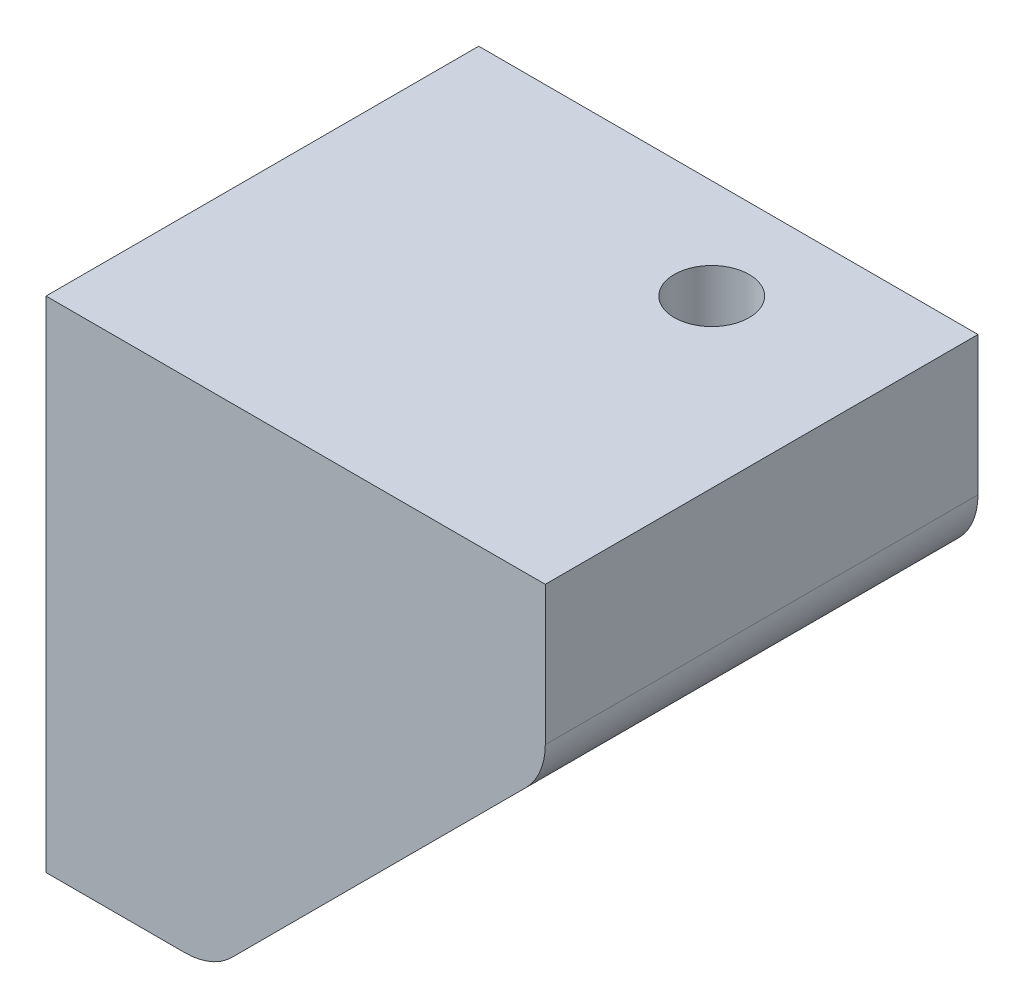
ISO-10303-21;
HEADER;
FILE_DESCRIPTION(('STEP AP214'),'2;1');
FILE_NAME('part.step','',(''),(''),'','','');
FILE_SCHEMA(('AUTOMOTIVE_DESIGN { 1 0 10303 214 1 1 1 1 }'));
ENDSEC;
DATA;
#1=APPLICATION_CONTEXT('core data for automotive mechanical design processes');
#2=APPLICATION_PROTOCOL_DEFINITION('international standard','automotive_design',2000,#1);
#3=PRODUCT_CONTEXT('',#1,'mechanical');
#4=PRODUCT('Part','Part','',(#3));
#5=PRODUCT_RELATED_PRODUCT_CATEGORY('part','',(#4));
#6=PRODUCT_DEFINITION_FORMATION('','',#4);
#7=PRODUCT_DEFINITION_CONTEXT('part definition',#1,'design');
#8=PRODUCT_DEFINITION('design','',#6,#7);
#9=PRODUCT_DEFINITION_SHAPE('','',#8);
#10=(LENGTH_UNIT() NAMED_UNIT(*) SI_UNIT(.MILLI.,.METRE.));
#11=(NAMED_UNIT(*) PLANE_ANGLE_UNIT() SI_UNIT($,.RADIAN.));
#12=(NAMED_UNIT(*) SI_UNIT($,.STERADIAN.) SOLID_ANGLE_UNIT());
#13=UNCERTAINTY_MEASURE_WITH_UNIT(LENGTH_MEASURE(1.E-05),#10,'distance_accuracy_value','');
#14=(GEOMETRIC_REPRESENTATION_CONTEXT(3) GLOBAL_UNCERTAINTY_ASSIGNED_CONTEXT((#13)) GLOBAL_UNIT_ASSIGNED_CONTEXT((#10,
#11,#12)) REPRESENTATION_CONTEXT('',''));
#15=CARTESIAN_POINT('',(0.,0.,0.));
#16=DIRECTION('',(0.,0.,1.));
#17=DIRECTION('',(1.,0.,0.));
#18=AXIS2_PLACEMENT_3D('',#15,#16,#17);
#19=CARTESIAN_POINT('',(0.,30.0000000000001,26.));
#20=DIRECTION('',(1.,0.,0.));
#21=DIRECTION('',(0.,1.,0.));
#22=AXIS2_PLACEMENT_3D('',#19,#20,#21);
#23=PLANE('',#22);
#24=CARTESIAN_POINT('',(0.,10.,18.));
#25=DIRECTION('',(-1.,0.,0.));
#26=DIRECTION('',(0.,-1.,0.));
#27=AXIS2_PLACEMENT_3D('',#24,#25,#26);
#28=CIRCLE('',#27,2.5);
#29=CARTESIAN_POINT('',(0.,7.50000000000004,18.));
#30=VERTEX_POINT('',#29);
#31=EDGE_CURVE('E146',#30,#30,#28,.T.);
#32=ORIENTED_EDGE('',*,*,#31,.F.);
#33=EDGE_LOOP('',(#32));
#34=FACE_BOUND('',#33,.T.);
#35=DIRECTION('',(0.,-1.,0.));
#36=VECTOR('',#35,1.);
#37=CARTESIAN_POINT('',(0.,30.0000000000001,0.));
#38=LINE('',#37,#36);
#39=CARTESIAN_POINT('',(0.,30.0000000000001,0.));
#40=VERTEX_POINT('',#39);
#41=CARTESIAN_POINT('',(0.,0.,0.));
#42=VERTEX_POINT('',#41);
#43=EDGE_CURVE('E127',#40,#42,#38,.T.);
#44=ORIENTED_EDGE('',*,*,#43,.T.);
#45=DIRECTION('',(0.,0.,-1.));
#46=VECTOR('',#45,1.);
#47=CARTESIAN_POINT('',(0.,0.,26.));
#48=LINE('',#47,#46);
#49=CARTESIAN_POINT('',(0.,0.,26.));
#50=VERTEX_POINT('',#49);
#51=EDGE_CURVE('E109',#50,#42,#48,.T.);
#52=ORIENTED_EDGE('',*,*,#51,.F.);
#53=DIRECTION('',(0.,-1.,0.));
#54=VECTOR('',#53,1.);
#55=CARTESIAN_POINT('',(0.,30.0000000000001,26.));
#56=LINE('',#55,#54);
#57=CARTESIAN_POINT('',(0.,30.0000000000001,26.));
#58=VERTEX_POINT('',#57);
#59=EDGE_CURVE('E114',#58,#50,#56,.T.);
#60=ORIENTED_EDGE('',*,*,#59,.F.);
#61=DIRECTION('',(0.,0.,-1.));
#62=VECTOR('',#61,1.);
#63=CARTESIAN_POINT('',(0.,30.0000000000001,26.));
#64=LINE('',#63,#62);
#65=EDGE_CURVE('E138',#58,#40,#64,.T.);
#66=ORIENTED_EDGE('',*,*,#65,.T.);
#67=EDGE_LOOP('',(#44,#52,#60,#66));
#68=FACE_BOUND('',#67,.T.);
#69=ADVANCED_FACE('F45',(#34,#68),#23,.F.);
#70=CARTESIAN_POINT('',(0.,0.,26.));
#71=DIRECTION('',(0.,1.,0.));
#72=DIRECTION('',(0.,0.,1.));
#73=AXIS2_PLACEMENT_3D('',#70,#71,#72);
#74=PLANE('',#73);
#75=DIRECTION('',(1.,0.,0.));
#76=VECTOR('',#75,1.);
#77=CARTESIAN_POINT('',(0.,0.,0.));
#78=LINE('',#77,#76);
#79=CARTESIAN_POINT('',(8.34314575050761,0.,0.));
#80=VERTEX_POINT('',#79);
#81=EDGE_CURVE('E190',#42,#80,#78,.T.);
#82=ORIENTED_EDGE('',*,*,#81,.T.);
#83=DIRECTION('',(0.,0.,-1.));
#84=VECTOR('',#83,1.);
#85=CARTESIAN_POINT('',(8.34314575050762,0.,26.));
#86=LINE('',#85,#84);
#87=CARTESIAN_POINT('',(8.34314575050761,0.,26.));
#88=VERTEX_POINT('',#87);
#89=EDGE_CURVE('E69',#80,#88,#86,.F.);
#90=ORIENTED_EDGE('',*,*,#89,.T.);
#91=DIRECTION('',(1.,0.,0.));
#92=VECTOR('',#91,1.);
#93=CARTESIAN_POINT('',(0.,0.,26.));
#94=LINE('',#93,#92);
#95=EDGE_CURVE('E105',#50,#88,#94,.T.);
#96=ORIENTED_EDGE('',*,*,#95,.F.);
#97=ORIENTED_EDGE('',*,*,#51,.T.);
#98=EDGE_LOOP('',(#82,#90,#96,#97));
#99=FACE_BOUND('',#98,.T.);
#100=ADVANCED_FACE('F107',(#99),#74,.F.);
#101=CARTESIAN_POINT('',(10.,0.,26.));
#102=DIRECTION('',(-0.707106781186549,0.707106781186546,0.));
#103=DIRECTION('',(-0.707106781186546,-0.707106781186549,0.));
#104=AXIS2_PLACEMENT_3D('',#101,#102,#103);
#105=PLANE('',#104);
#106=CARTESIAN_POINT('',(20.,10.,6.));
#107=DIRECTION('',(-0.707106781186549,0.707106781186546,0.));
#108=DIRECTION('',(0.707106781186546,0.707106781186549,0.));
#109=AXIS2_PLACEMENT_3D('',#106,#107,#108);
#110=ELLIPSE('',#109,5.65685424949239,4.);
#111=CARTESIAN_POINT('',(24.,14.0000000000001,6.));
#112=VERTEX_POINT('',#111);
#113=EDGE_CURVE('E147',#112,#112,#110,.T.);
#114=ORIENTED_EDGE('',*,*,#113,.T.);
#115=EDGE_LOOP('',(#114));
#116=FACE_BOUND('',#115,.T.);
#117=CARTESIAN_POINT('',(20.,10.,18.));
#118=DIRECTION('',(-0.707106781186549,0.707106781186546,0.));
#119=DIRECTION('',(-0.707106781186546,-0.707106781186549,0.));
#120=AXIS2_PLACEMENT_3D('',#117,#118,#119);
#121=ELLIPSE('',#120,7.07106781186546,5.);
#122=CARTESIAN_POINT('',(15.,5.00000000000004,18.));
#123=VERTEX_POINT('',#122);
#124=EDGE_CURVE('E142',#123,#123,#121,.T.);
#125=ORIENTED_EDGE('',*,*,#124,.T.);
#126=EDGE_LOOP('',(#125));
#127=FACE_BOUND('',#126,.T.);
#128=DIRECTION('',(0.707106781186546,0.707106781186549,0.));
#129=VECTOR('',#128,1.);
#130=CARTESIAN_POINT('',(10.,0.,26.));
#131=LINE('',#130,#129);
#132=CARTESIAN_POINT('',(11.1715728752538,1.17157287525382,26.));
#133=VERTEX_POINT('',#132);
#134=CARTESIAN_POINT('',(28.8284271247462,18.8284271247463,26.));
#135=VERTEX_POINT('',#134);
#136=EDGE_CURVE('E113',#133,#135,#131,.T.);
#137=ORIENTED_EDGE('',*,*,#136,.F.);
#138=DIRECTION('',(0.,0.,-1.));
#139=VECTOR('',#138,1.);
#140=CARTESIAN_POINT('',(11.1715728752538,1.17157287525382,26.));
#141=LINE('',#140,#139);
#142=CARTESIAN_POINT('',(11.1715728752538,1.17157287525382,0.));
#143=VERTEX_POINT('',#142);
#144=EDGE_CURVE('E162',#133,#143,#141,.T.);
#145=ORIENTED_EDGE('',*,*,#144,.T.);
#146=DIRECTION('',(0.707106781186546,0.707106781186549,0.));
#147=VECTOR('',#146,1.);
#148=CARTESIAN_POINT('',(10.,0.,0.));
#149=LINE('',#148,#147);
#150=CARTESIAN_POINT('',(28.8284271247462,18.8284271247463,0.));
#151=VERTEX_POINT('',#150);
#152=EDGE_CURVE('E191',#143,#151,#149,.T.);
#153=ORIENTED_EDGE('',*,*,#152,.T.);
#154=DIRECTION('',(0.,0.,-1.));
#155=VECTOR('',#154,1.);
#156=CARTESIAN_POINT('',(28.8284271247462,18.8284271247463,26.));
#157=LINE('',#156,#155);
#158=EDGE_CURVE('E159',#151,#135,#157,.F.);
#159=ORIENTED_EDGE('',*,*,#158,.T.);
#160=EDGE_LOOP('',(#137,#145,#153,#159));
#161=FACE_BOUND('',#160,.T.);
#162=ADVANCED_FACE('F180',(#116,#127,#161),#105,.F.);
#163=CARTESIAN_POINT('',(30.,20.0000000000001,26.));
#164=DIRECTION('',(-1.,0.,0.));
#165=DIRECTION('',(0.,0.,1.));
#166=AXIS2_PLACEMENT_3D('',#163,#164,#165);
#167=PLANE('',#166);
#168=DIRECTION('',(0.,1.,0.));
#169=VECTOR('',#168,1.);
#170=CARTESIAN_POINT('',(30.,20.0000000000001,26.));
#171=LINE('',#170,#169);
#172=CARTESIAN_POINT('',(30.,21.6568542494925,26.));
#173=VERTEX_POINT('',#172);
#174=CARTESIAN_POINT('',(30.,30.0000000000001,26.));
#175=VERTEX_POINT('',#174);
#176=EDGE_CURVE('E185',#173,#175,#171,.T.);
#177=ORIENTED_EDGE('',*,*,#176,.F.);
#178=DIRECTION('',(0.,0.,-1.));
#179=VECTOR('',#178,1.);
#180=CARTESIAN_POINT('',(30.,21.6568542494925,26.));
#181=LINE('',#180,#179);
#182=CARTESIAN_POINT('',(30.,21.6568542494925,0.));
#183=VERTEX_POINT('',#182);
#184=EDGE_CURVE('E11',#173,#183,#181,.T.);
#185=ORIENTED_EDGE('',*,*,#184,.T.);
#186=DIRECTION('',(0.,1.,0.));
#187=VECTOR('',#186,1.);
#188=CARTESIAN_POINT('',(30.,20.0000000000001,0.));
#189=LINE('',#188,#187);
#190=CARTESIAN_POINT('',(30.,30.0000000000001,0.));
#191=VERTEX_POINT('',#190);
#192=EDGE_CURVE('E196',#183,#191,#189,.T.);
#193=ORIENTED_EDGE('',*,*,#192,.T.);
#194=DIRECTION('',(0.,0.,-1.));
#195=VECTOR('',#194,1.);
#196=CARTESIAN_POINT('',(30.,30.0000000000001,26.));
#197=LINE('',#196,#195);
#198=EDGE_CURVE('E130',#175,#191,#197,.T.);
#199=ORIENTED_EDGE('',*,*,#198,.F.);
#200=EDGE_LOOP('',(#177,#185,#193,#199));
#201=FACE_BOUND('',#200,.T.);
#202=ADVANCED_FACE('F240',(#201),#167,.F.);
#203=CARTESIAN_POINT('',(30.,30.0000000000001,26.));
#204=DIRECTION('',(0.,-1.,0.));
#205=DIRECTION('',(1.,0.,0.));
#206=AXIS2_PLACEMENT_3D('',#203,#204,#205);
#207=PLANE('',#206);
#208=CARTESIAN_POINT('',(20.,30.0000000000001,6.));
#209=DIRECTION('',(0.,1.,0.));
#210=DIRECTION('',(-1.,0.,0.));
#211=AXIS2_PLACEMENT_3D('',#208,#209,#210);
#212=CIRCLE('',#211,2.25);
#213=CARTESIAN_POINT('',(17.75,30.0000000000001,6.));
#214=VERTEX_POINT('',#213);
#215=EDGE_CURVE('E198',#214,#214,#212,.T.);
#216=ORIENTED_EDGE('',*,*,#215,.F.);
#217=EDGE_LOOP('',(#216));
#218=FACE_BOUND('',#217,.T.);
#219=DIRECTION('',(-1.,0.,0.));
#220=VECTOR('',#219,1.);
#221=CARTESIAN_POINT('',(30.,30.0000000000001,0.));
#222=LINE('',#221,#220);
#223=EDGE_CURVE('E124',#191,#40,#222,.T.);
#224=ORIENTED_EDGE('',*,*,#223,.T.);
#225=ORIENTED_EDGE('',*,*,#65,.F.);
#226=DIRECTION('',(-1.,0.,0.));
#227=VECTOR('',#226,1.);
#228=CARTESIAN_POINT('',(30.,30.0000000000001,26.));
#229=LINE('',#228,#227);
#230=EDGE_CURVE('E119',#175,#58,#229,.T.);
#231=ORIENTED_EDGE('',*,*,#230,.F.);
#232=ORIENTED_EDGE('',*,*,#198,.T.);
#233=EDGE_LOOP('',(#224,#225,#231,#232));
#234=FACE_BOUND('',#233,.T.);
#235=ADVANCED_FACE('F237',(#218,#234),#207,.F.);
#236=CARTESIAN_POINT('',(0.,0.,26.));
#237=DIRECTION('',(0.,0.,1.));
#238=DIRECTION('',(1.,0.,0.));
#239=AXIS2_PLACEMENT_3D('',#236,#237,#238);
#240=PLANE('',#239);
#241=ORIENTED_EDGE('',*,*,#95,.T.);
#242=CARTESIAN_POINT('',(8.34314575050762,4.,26.));
#243=DIRECTION('',(0.,0.,1.));
#244=DIRECTION('',(1.,0.,0.));
#245=AXIS2_PLACEMENT_3D('',#242,#243,#244);
#246=CIRCLE('',#245,4.);
#247=EDGE_CURVE('E54',#88,#133,#246,.T.);
#248=ORIENTED_EDGE('',*,*,#247,.T.);
#249=ORIENTED_EDGE('',*,*,#136,.T.);
#250=CARTESIAN_POINT('',(26.,21.6568542494925,26.));
#251=DIRECTION('',(0.,0.,1.));
#252=DIRECTION('',(1.,0.,0.));
#253=AXIS2_PLACEMENT_3D('',#250,#251,#252);
#254=CIRCLE('',#253,4.);
#255=EDGE_CURVE('E61',#135,#173,#254,.T.);
#256=ORIENTED_EDGE('',*,*,#255,.T.);
#257=ORIENTED_EDGE('',*,*,#176,.T.);
#258=ORIENTED_EDGE('',*,*,#230,.T.);
#259=ORIENTED_EDGE('',*,*,#59,.T.);
#260=EDGE_LOOP('',(#241,#248,#249,#256,#257,#258,#259));
#261=FACE_BOUND('',#260,.T.);
#262=ADVANCED_FACE('F117',(#261),#240,.T.);
#263=CARTESIAN_POINT('',(0.,0.,0.));
#264=DIRECTION('',(0.,0.,1.));
#265=DIRECTION('',(1.,0.,0.));
#266=AXIS2_PLACEMENT_3D('',#263,#264,#265);
#267=PLANE('',#266);
#268=ORIENTED_EDGE('',*,*,#152,.F.);
#269=CARTESIAN_POINT('',(8.34314575050762,4.,0.));
#270=DIRECTION('',(0.,0.,1.));
#271=DIRECTION('',(1.,0.,0.));
#272=AXIS2_PLACEMENT_3D('',#269,#270,#271);
#273=CIRCLE('',#272,4.);
#274=EDGE_CURVE('E169',#143,#80,#273,.F.);
#275=ORIENTED_EDGE('',*,*,#274,.T.);
#276=ORIENTED_EDGE('',*,*,#81,.F.);
#277=ORIENTED_EDGE('',*,*,#43,.F.);
#278=ORIENTED_EDGE('',*,*,#223,.F.);
#279=ORIENTED_EDGE('',*,*,#192,.F.);
#280=CARTESIAN_POINT('',(26.,21.6568542494925,0.));
#281=DIRECTION('',(0.,0.,1.));
#282=DIRECTION('',(1.,0.,0.));
#283=AXIS2_PLACEMENT_3D('',#280,#281,#282);
#284=CIRCLE('',#283,4.);
#285=EDGE_CURVE('E166',#183,#151,#284,.F.);
#286=ORIENTED_EDGE('',*,*,#285,.T.);
#287=EDGE_LOOP('',(#268,#275,#276,#277,#278,#279,#286));
#288=FACE_BOUND('',#287,.T.);
#289=ADVANCED_FACE('F189',(#288),#267,.F.);
#290=CARTESIAN_POINT('',(20.,0.,6.));
#291=DIRECTION('',(0.,1.,0.));
#292=DIRECTION('',(-1.,0.,0.));
#293=AXIS2_PLACEMENT_3D('',#290,#291,#292);
#294=CYLINDRICAL_SURFACE('',#293,2.25);
#295=CARTESIAN_POINT('',(20.,20.0000000000001,6.));
#296=DIRECTION('',(0.,1.,0.));
#297=DIRECTION('',(-1.,0.,0.));
#298=AXIS2_PLACEMENT_3D('',#295,#296,#297);
#299=CIRCLE('',#298,2.25);
#300=CARTESIAN_POINT('',(17.75,20.0000000000001,6.));
#301=VERTEX_POINT('',#300);
#302=EDGE_CURVE('E148',#301,#301,#299,.F.);
#303=CARTESIAN_POINT('',(17.75,20.0000000000001,6.));
#304=CARTESIAN_POINT('',(17.75,20.1041666666667,6.));
#305=CARTESIAN_POINT('',(17.75,20.2083333333334,6.));
#306=CARTESIAN_POINT('',(17.75,20.4166666666667,6.));
#307=CARTESIAN_POINT('',(17.75,20.5208333333334,6.));
#308=CARTESIAN_POINT('',(17.75,20.7291666666667,6.));
#309=CARTESIAN_POINT('',(17.75,20.8333333333334,6.));
#310=CARTESIAN_POINT('',(17.75,21.0416666666667,6.));
#311=CARTESIAN_POINT('',(17.75,21.1458333333334,6.));
#312=CARTESIAN_POINT('',(17.75,21.3541666666667,6.));
#313=CARTESIAN_POINT('',(17.75,21.4583333333334,6.));
#314=CARTESIAN_POINT('',(17.75,21.6666666666667,6.));
#315=CARTESIAN_POINT('',(17.75,21.7708333333334,6.));
#316=CARTESIAN_POINT('',(17.75,21.9791666666667,6.));
#317=CARTESIAN_POINT('',(17.75,22.0833333333334,6.));
#318=CARTESIAN_POINT('',(17.75,22.2916666666667,6.));
#319=CARTESIAN_POINT('',(17.75,22.3958333333334,6.));
#320=CARTESIAN_POINT('',(17.75,22.6041666666667,6.));
#321=CARTESIAN_POINT('',(17.75,22.7083333333334,6.));
#322=CARTESIAN_POINT('',(17.75,22.9166666666667,6.));
#323=CARTESIAN_POINT('',(17.75,23.0208333333334,6.));
#324=CARTESIAN_POINT('',(17.75,23.2291666666667,6.));
#325=CARTESIAN_POINT('',(17.75,23.3333333333334,6.));
#326=CARTESIAN_POINT('',(17.75,23.5416666666667,6.));
#327=CARTESIAN_POINT('',(17.75,23.6458333333334,6.));
#328=CARTESIAN_POINT('',(17.75,23.8541666666667,6.));
#329=CARTESIAN_POINT('',(17.75,23.9583333333334,6.));
#330=CARTESIAN_POINT('',(17.75,24.1666666666667,6.));
#331=CARTESIAN_POINT('',(17.75,24.2708333333334,6.));
#332=CARTESIAN_POINT('',(17.75,24.4791666666667,6.));
#333=CARTESIAN_POINT('',(17.75,24.5833333333334,6.));
#334=CARTESIAN_POINT('',(17.75,24.7916666666667,6.));
#335=CARTESIAN_POINT('',(17.75,24.8958333333334,6.));
#336=CARTESIAN_POINT('',(17.75,25.1041666666667,6.));
#337=CARTESIAN_POINT('',(17.75,25.2083333333334,6.));
#338=CARTESIAN_POINT('',(17.75,25.4166666666667,6.));
#339=CARTESIAN_POINT('',(17.75,25.5208333333334,6.));
#340=CARTESIAN_POINT('',(17.75,25.7291666666667,6.));
#341=CARTESIAN_POINT('',(17.75,25.8333333333334,6.));
#342=CARTESIAN_POINT('',(17.75,26.0416666666667,6.));
#343=CARTESIAN_POINT('',(17.75,26.1458333333334,6.));
#344=CARTESIAN_POINT('',(17.75,26.3541666666667,6.));
#345=CARTESIAN_POINT('',(17.75,26.4583333333334,6.));
#346=CARTESIAN_POINT('',(17.75,26.6666666666667,6.));
#347=CARTESIAN_POINT('',(17.75,26.7708333333334,6.));
#348=CARTESIAN_POINT('',(17.75,26.9791666666667,6.));
#349=CARTESIAN_POINT('',(17.75,27.0833333333334,6.));
#350=CARTESIAN_POINT('',(17.75,27.2916666666667,6.));
#351=CARTESIAN_POINT('',(17.75,27.3958333333334,6.));
#352=CARTESIAN_POINT('',(17.75,27.6041666666667,6.));
#353=CARTESIAN_POINT('',(17.75,27.7083333333334,6.));
#354=CARTESIAN_POINT('',(17.75,27.9166666666667,6.));
#355=CARTESIAN_POINT('',(17.75,28.0208333333334,6.));
#356=CARTESIAN_POINT('',(17.75,28.2291666666667,6.));
#357=CARTESIAN_POINT('',(17.75,28.3333333333334,6.));
#358=CARTESIAN_POINT('',(17.75,28.5416666666667,6.));
#359=CARTESIAN_POINT('',(17.75,28.6458333333334,6.));
#360=CARTESIAN_POINT('',(17.75,28.8541666666667,6.));
#361=CARTESIAN_POINT('',(17.75,28.9583333333334,6.));
#362=CARTESIAN_POINT('',(17.75,29.1666666666667,6.));
#363=CARTESIAN_POINT('',(17.75,29.2708333333334,6.));
#364=CARTESIAN_POINT('',(17.75,29.4791666666667,6.));
#365=CARTESIAN_POINT('',(17.75,29.5833333333334,6.));
#366=CARTESIAN_POINT('',(17.75,29.7916666666667,6.));
#367=CARTESIAN_POINT('',(17.75,29.8958333333334,6.));
#368=CARTESIAN_POINT('',(17.75,30.0000000000001,6.));
#369=B_SPLINE_CURVE_WITH_KNOTS('',3,(#303,#304,#305,#306,#307,#308,#309,#310,#311,#312,#313,
#314,#315,#316,#317,#318,#319,#320,#321,#322,#323,#324,#325,#326,#327,#328,#329,#330,#331,#332,
#333,#334,#335,#336,#337,#338,#339,#340,#341,#342,#343,#344,#345,#346,#347,#348,#349,#350,#351,
#352,#353,#354,#355,#356,#357,#358,#359,#360,#361,#362,#363,#364,#365,#366,#367,#368),
.UNSPECIFIED.,.F.,.F.,(4,2,2,2,2,2,2,2,2,2,2,2,2,2,2,2,2,2,2,2,2,2,2,2,2,2,2,2,2,2,2,2,4),(0.,
0.3125,0.625000000000001,0.937500000000001,1.25,1.5625,1.875,2.1875,2.5,2.8125,3.125,3.4375,
3.75,4.0625,4.375,4.6875,5.,5.3125,5.625,5.9375,6.25,6.5625,6.875,7.1875,7.5,7.8125,8.125,
8.43749999999999,8.74999999999999,9.06249999999999,9.37499999999999,9.68749999999999,
9.99999999999999),.UNSPECIFIED.);
#370=EDGE_CURVE('BSEAM230',#301,#214,#369,.T.);
#371=ORIENTED_EDGE('',*,*,#302,.T.);
#372=ORIENTED_EDGE('',*,*,#215,.T.);
#373=ORIENTED_EDGE('',*,*,#370,.T.);
#374=ORIENTED_EDGE('',*,*,#370,.F.);
#375=EDGE_LOOP('',(#371,#373,#372,#374));
#376=FACE_BOUND('',#375,.T.);
#377=ADVANCED_FACE('F230',(#376),#294,.F.);
#378=CARTESIAN_POINT('',(30.,10.,18.));
#379=DIRECTION('',(-1.,0.,0.));
#380=DIRECTION('',(0.,-1.,0.));
#381=AXIS2_PLACEMENT_3D('',#378,#379,#380);
#382=CYLINDRICAL_SURFACE('',#381,2.5);
#383=CARTESIAN_POINT('',(10.5,10.,18.));
#384=DIRECTION('',(1.,0.,0.));
#385=DIRECTION('',(0.,0.,-1.));
#386=AXIS2_PLACEMENT_3D('',#383,#384,#385);
#387=CIRCLE('',#386,2.5);
#388=CARTESIAN_POINT('',(10.5,7.50000000000004,18.));
#389=VERTEX_POINT('',#388);
#390=EDGE_CURVE('E135',#389,#389,#387,.T.);
#391=CARTESIAN_POINT('',(10.5,7.50000000000004,18.));
#392=CARTESIAN_POINT('',(10.390625,7.50000000000004,18.));
#393=CARTESIAN_POINT('',(10.28125,7.50000000000004,18.));
#394=CARTESIAN_POINT('',(10.0625,7.50000000000004,18.));
#395=CARTESIAN_POINT('',(9.95312500000003,7.50000000000004,18.));
#396=CARTESIAN_POINT('',(9.73437500000003,7.50000000000004,18.));
#397=CARTESIAN_POINT('',(9.62500000000003,7.50000000000004,18.));
#398=CARTESIAN_POINT('',(9.40625000000003,7.50000000000004,18.));
#399=CARTESIAN_POINT('',(9.29687500000002,7.50000000000004,18.));
#400=CARTESIAN_POINT('',(9.07812500000002,7.50000000000004,18.));
#401=CARTESIAN_POINT('',(8.96875000000003,7.50000000000004,18.));
#402=CARTESIAN_POINT('',(8.75000000000003,7.50000000000004,18.));
#403=CARTESIAN_POINT('',(8.64062500000002,7.50000000000004,18.));
#404=CARTESIAN_POINT('',(8.42187500000002,7.50000000000004,18.));
#405=CARTESIAN_POINT('',(8.31250000000002,7.50000000000004,18.));
#406=CARTESIAN_POINT('',(8.09375000000002,7.50000000000004,18.));
#407=CARTESIAN_POINT('',(7.98437500000002,7.50000000000004,18.));
#408=CARTESIAN_POINT('',(7.76562500000002,7.50000000000004,18.));
#409=CARTESIAN_POINT('',(7.65625000000002,7.50000000000004,18.));
#410=CARTESIAN_POINT('',(7.43750000000002,7.50000000000004,18.));
#411=CARTESIAN_POINT('',(7.32812500000002,7.50000000000004,18.));
#412=CARTESIAN_POINT('',(7.10937500000002,7.50000000000004,18.));
#413=CARTESIAN_POINT('',(7.00000000000002,7.50000000000004,18.));
#414=CARTESIAN_POINT('',(6.78125000000002,7.50000000000004,18.));
#415=CARTESIAN_POINT('',(6.67187500000002,7.50000000000004,18.));
#416=CARTESIAN_POINT('',(6.45312500000002,7.50000000000004,18.));
#417=CARTESIAN_POINT('',(6.34375000000002,7.50000000000004,18.));
#418=CARTESIAN_POINT('',(6.12500000000002,7.50000000000004,18.));
#419=CARTESIAN_POINT('',(6.01562500000002,7.50000000000004,18.));
#420=CARTESIAN_POINT('',(5.79687500000002,7.50000000000004,18.));
#421=CARTESIAN_POINT('',(5.68750000000002,7.50000000000004,18.));
#422=CARTESIAN_POINT('',(5.46875000000002,7.50000000000004,18.));
#423=CARTESIAN_POINT('',(5.35937500000002,7.50000000000004,18.));
#424=CARTESIAN_POINT('',(5.14062500000001,7.50000000000004,18.));
#425=CARTESIAN_POINT('',(5.03125000000001,7.50000000000004,18.));
#426=CARTESIAN_POINT('',(4.81250000000001,7.50000000000004,18.));
#427=CARTESIAN_POINT('',(4.70312500000001,7.50000000000004,18.));
#428=CARTESIAN_POINT('',(4.48437500000001,7.50000000000004,18.));
#429=CARTESIAN_POINT('',(4.37500000000001,7.50000000000004,18.));
#430=CARTESIAN_POINT('',(4.15625000000001,7.50000000000004,18.));
#431=CARTESIAN_POINT('',(4.04687500000001,7.50000000000004,18.));
#432=CARTESIAN_POINT('',(3.82812500000001,7.50000000000004,18.));
#433=CARTESIAN_POINT('',(3.71875000000001,7.50000000000004,18.));
#434=CARTESIAN_POINT('',(3.50000000000001,7.50000000000004,18.));
#435=CARTESIAN_POINT('',(3.39062500000001,7.50000000000004,18.));
#436=CARTESIAN_POINT('',(3.17187500000001,7.50000000000004,18.));
#437=CARTESIAN_POINT('',(3.06250000000001,7.50000000000004,18.));
#438=CARTESIAN_POINT('',(2.84375000000001,7.50000000000004,18.));
#439=CARTESIAN_POINT('',(2.73437500000001,7.50000000000004,18.));
#440=CARTESIAN_POINT('',(2.51562500000001,7.50000000000004,18.));
#441=CARTESIAN_POINT('',(2.40625000000001,7.50000000000004,18.));
#442=CARTESIAN_POINT('',(2.18750000000001,7.50000000000004,18.));
#443=CARTESIAN_POINT('',(2.07812500000001,7.50000000000004,18.));
#444=CARTESIAN_POINT('',(1.85937500000001,7.50000000000004,18.));
#445=CARTESIAN_POINT('',(1.75000000000001,7.50000000000004,18.));
#446=CARTESIAN_POINT('',(1.53125000000001,7.50000000000004,18.));
#447=CARTESIAN_POINT('',(1.42187500000001,7.50000000000004,18.));
#448=CARTESIAN_POINT('',(1.203125,7.50000000000004,18.));
#449=CARTESIAN_POINT('',(1.09375,7.50000000000004,18.));
#450=CARTESIAN_POINT('',(0.875000000000003,7.50000000000004,18.));
#451=CARTESIAN_POINT('',(0.765625000000004,7.50000000000004,18.));
#452=CARTESIAN_POINT('',(0.546875000000002,7.50000000000004,18.));
#453=CARTESIAN_POINT('',(0.4375,7.50000000000004,18.));
#454=CARTESIAN_POINT('',(0.218749999999999,7.50000000000004,18.));
#455=CARTESIAN_POINT('',(0.109374999999999,7.50000000000004,18.));
#456=CARTESIAN_POINT('',(0.,7.50000000000004,18.));
#457=B_SPLINE_CURVE_WITH_KNOTS('',3,(#391,#392,#393,#394,#395,#396,#397,#398,#399,#400,#401,
#402,#403,#404,#405,#406,#407,#408,#409,#410,#411,#412,#413,#414,#415,#416,#417,#418,#419,#420,
#421,#422,#423,#424,#425,#426,#427,#428,#429,#430,#431,#432,#433,#434,#435,#436,#437,#438,#439,
#440,#441,#442,#443,#444,#445,#446,#447,#448,#449,#450,#451,#452,#453,#454,#455,#456),
.UNSPECIFIED.,.F.,.F.,(4,2,2,2,2,2,2,2,2,2,2,2,2,2,2,2,2,2,2,2,2,2,2,2,2,2,2,2,2,2,2,2,4),(0.,
0.328125000000002,0.656250000000001,0.984375000000003,1.3125,1.640625,1.96875000000001,
2.29687500000001,2.62500000000001,2.95312500000001,3.28125000000001,3.60937500000001,
3.93750000000001,4.26562500000001,4.59375000000001,4.92187500000001,5.25000000000002,
5.57812500000002,5.90625000000002,6.23437500000002,6.56250000000002,6.89062500000002,
7.21875000000002,7.54687500000002,7.87500000000002,8.20312500000002,8.53125000000002,
8.85937500000002,9.18750000000002,9.51562500000003,9.84375000000003,10.171875,10.5),.UNSPECIFIED.);
#458=EDGE_CURVE('BSEAM233',#389,#30,#457,.T.);
#459=ORIENTED_EDGE('',*,*,#390,.T.);
#460=ORIENTED_EDGE('',*,*,#31,.T.);
#461=ORIENTED_EDGE('',*,*,#458,.T.);
#462=ORIENTED_EDGE('',*,*,#458,.F.);
#463=EDGE_LOOP('',(#459,#461,#460,#462));
#464=FACE_BOUND('',#463,.T.);
#465=ADVANCED_FACE('F233',(#464),#382,.F.);
#466=CARTESIAN_POINT('',(30.,10.,18.));
#467=DIRECTION('',(-1.,0.,0.));
#468=DIRECTION('',(0.,-1.,0.));
#469=AXIS2_PLACEMENT_3D('',#466,#467,#468);
#470=CYLINDRICAL_SURFACE('',#469,5.);
#471=CARTESIAN_POINT('',(13.0000000000001,10.,18.));
#472=DIRECTION('',(-1.,0.,0.));
#473=DIRECTION('',(0.,0.,1.));
#474=AXIS2_PLACEMENT_3D('',#471,#472,#473);
#475=CIRCLE('',#474,5.);
#476=CARTESIAN_POINT('',(13.0000000000001,10.,23.));
#477=VERTEX_POINT('',#476);
#478=EDGE_CURVE('E129',#477,#477,#475,.T.);
#479=ORIENTED_EDGE('',*,*,#478,.T.);
#480=EDGE_LOOP('',(#479));
#481=FACE_BOUND('',#480,.T.);
#482=ORIENTED_EDGE('',*,*,#124,.F.);
#483=EDGE_LOOP('',(#482));
#484=FACE_BOUND('',#483,.T.);
#485=ADVANCED_FACE('F273',(#481,#484),#470,.F.);
#486=CARTESIAN_POINT('',(20.,0.,6.));
#487=DIRECTION('',(0.,1.,0.));
#488=DIRECTION('',(-1.,0.,0.));
#489=AXIS2_PLACEMENT_3D('',#486,#487,#488);
#490=CYLINDRICAL_SURFACE('',#489,4.);
#491=CARTESIAN_POINT('',(20.,20.0000000000001,6.));
#492=DIRECTION('',(0.,1.,0.));
#493=DIRECTION('',(-1.,0.,0.));
#494=AXIS2_PLACEMENT_3D('',#491,#492,#493);
#495=CIRCLE('',#494,4.);
#496=CARTESIAN_POINT('',(16.,20.0000000000001,6.));
#497=VERTEX_POINT('',#496);
#498=EDGE_CURVE('E152',#497,#497,#495,.T.);
#499=ORIENTED_EDGE('',*,*,#498,.T.);
#500=EDGE_LOOP('',(#499));
#501=FACE_BOUND('',#500,.T.);
#502=ORIENTED_EDGE('',*,*,#113,.F.);
#503=EDGE_LOOP('',(#502));
#504=FACE_BOUND('',#503,.T.);
#505=ADVANCED_FACE('F220',(#501,#504),#490,.F.);
#506=CARTESIAN_POINT('',(20.,20.0000000000001,6.));
#507=DIRECTION('',(0.,1.,0.));
#508=DIRECTION('',(-1.,0.,0.));
#509=AXIS2_PLACEMENT_3D('',#506,#507,#508);
#510=PLANE('',#509);
#511=ORIENTED_EDGE('',*,*,#498,.F.);
#512=EDGE_LOOP('',(#511));
#513=FACE_BOUND('',#512,.T.);
#514=ORIENTED_EDGE('',*,*,#302,.F.);
#515=EDGE_LOOP('',(#514));
#516=FACE_BOUND('',#515,.T.);
#517=ADVANCED_FACE('F223',(#513,#516),#510,.F.);
#518=CARTESIAN_POINT('',(13.0000000000001,10.,18.));
#519=DIRECTION('',(1.,0.,0.));
#520=DIRECTION('',(0.,0.,-1.));
#521=AXIS2_PLACEMENT_3D('',#518,#519,#520);
#522=CONICAL_SURFACE('',#521,5.,0.785398163397443);
#523=ORIENTED_EDGE('',*,*,#390,.F.);
#524=EDGE_LOOP('',(#523));
#525=FACE_BOUND('',#524,.T.);
#526=ORIENTED_EDGE('',*,*,#478,.F.);
#527=EDGE_LOOP('',(#526));
#528=FACE_BOUND('',#527,.T.);
#529=ADVANCED_FACE('F226',(#525,#528),#522,.F.);
#530=CARTESIAN_POINT('',(8.34314575050762,4.,26.));
#531=DIRECTION('',(0.,0.,-1.));
#532=DIRECTION('',(-1.,0.,0.));
#533=AXIS2_PLACEMENT_3D('',#530,#531,#532);
#534=CYLINDRICAL_SURFACE('',#533,4.);
#535=ORIENTED_EDGE('',*,*,#247,.F.);
#536=ORIENTED_EDGE('',*,*,#89,.F.);
#537=ORIENTED_EDGE('',*,*,#274,.F.);
#538=ORIENTED_EDGE('',*,*,#144,.F.);
#539=EDGE_LOOP('',(#535,#536,#537,#538));
#540=FACE_BOUND('',#539,.T.);
#541=ADVANCED_FACE('F187',(#540),#534,.T.);
#542=CARTESIAN_POINT('',(26.,21.6568542494925,26.));
#543=DIRECTION('',(0.,0.,-1.));
#544=DIRECTION('',(-1.,0.,0.));
#545=AXIS2_PLACEMENT_3D('',#542,#543,#544);
#546=CYLINDRICAL_SURFACE('',#545,4.);
#547=ORIENTED_EDGE('',*,*,#255,.F.);
#548=ORIENTED_EDGE('',*,*,#158,.F.);
#549=ORIENTED_EDGE('',*,*,#285,.F.);
#550=ORIENTED_EDGE('',*,*,#184,.F.);
#551=EDGE_LOOP('',(#547,#548,#549,#550));
#552=FACE_BOUND('',#551,.T.);
#553=ADVANCED_FACE('F47',(#552),#546,.T.);
#554=CLOSED_SHELL('',(#69,#100,#162,#202,#235,#262,#289,#377,#465,#485,#505,#517,#529,#541,#553));
#555=MANIFOLD_SOLID_BREP('B2',#554);
#556=ADVANCED_BREP_SHAPE_REPRESENTATION('',(#18,#555),#14);
#557=SHAPE_DEFINITION_REPRESENTATION(#9,#556);
ENDSEC;
END-ISO-10303-21;
